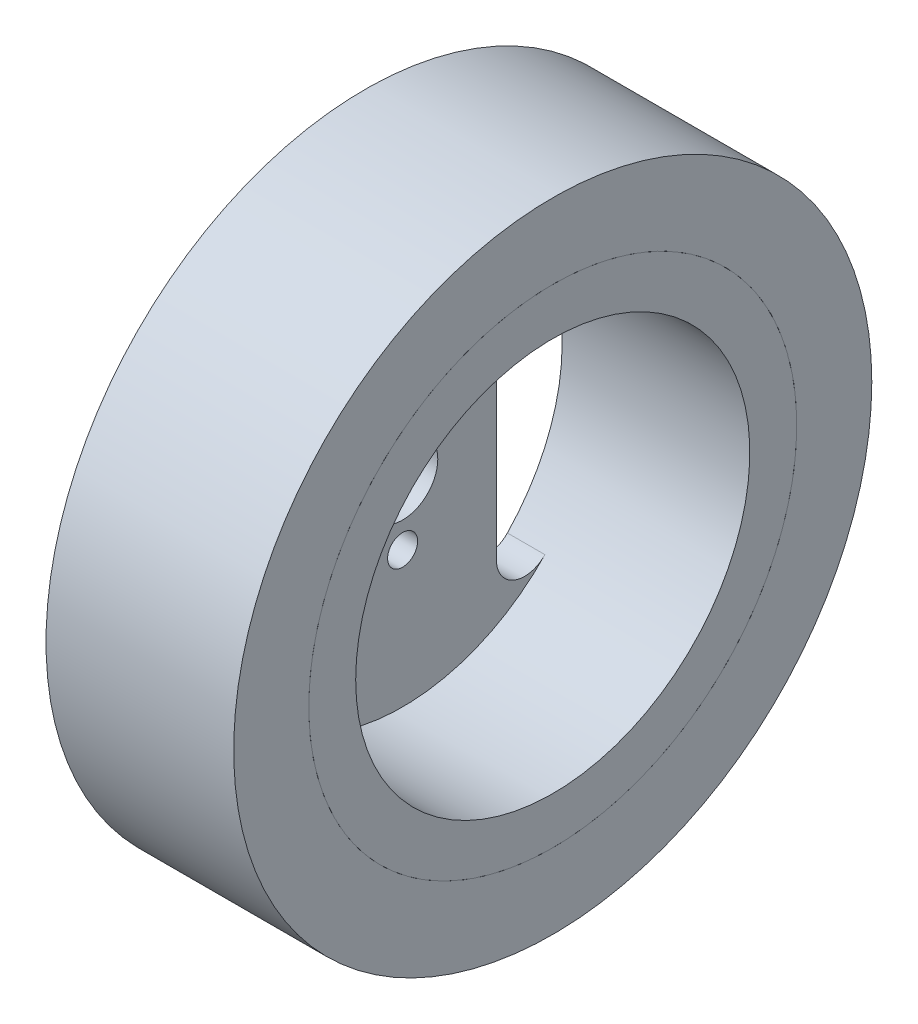
ISO-10303-21;
HEADER;
FILE_DESCRIPTION(('STEP AP214'),'2;1');
FILE_NAME('part.step','',(''),(''),'','','');
FILE_SCHEMA(('AUTOMOTIVE_DESIGN { 1 0 10303 214 1 1 1 1 }'));
ENDSEC;
DATA;
#1=APPLICATION_CONTEXT('core data for automotive mechanical design processes');
#2=APPLICATION_PROTOCOL_DEFINITION('international standard','automotive_design',2000,#1);
#3=PRODUCT_CONTEXT('',#1,'mechanical');
#4=PRODUCT('Part','Part','',(#3));
#5=PRODUCT_RELATED_PRODUCT_CATEGORY('part','',(#4));
#6=PRODUCT_DEFINITION_FORMATION('','',#4);
#7=PRODUCT_DEFINITION_CONTEXT('part definition',#1,'design');
#8=PRODUCT_DEFINITION('design','',#6,#7);
#9=PRODUCT_DEFINITION_SHAPE('','',#8);
#10=(LENGTH_UNIT() NAMED_UNIT(*) SI_UNIT(.MILLI.,.METRE.));
#11=(NAMED_UNIT(*) PLANE_ANGLE_UNIT() SI_UNIT($,.RADIAN.));
#12=(NAMED_UNIT(*) SI_UNIT($,.STERADIAN.) SOLID_ANGLE_UNIT());
#13=UNCERTAINTY_MEASURE_WITH_UNIT(LENGTH_MEASURE(1.E-05),#10,'distance_accuracy_value','');
#14=(GEOMETRIC_REPRESENTATION_CONTEXT(3) GLOBAL_UNCERTAINTY_ASSIGNED_CONTEXT((#13)) GLOBAL_UNIT_ASSIGNED_CONTEXT((#10,
#11,#12)) REPRESENTATION_CONTEXT('',''));
#15=CARTESIAN_POINT('',(0.,0.,0.));
#16=DIRECTION('',(0.,0.,1.));
#17=DIRECTION('',(1.,0.,0.));
#18=AXIS2_PLACEMENT_3D('',#15,#16,#17);
#19=CARTESIAN_POINT('',(-96.1665222413705,0.,0.));
#20=DIRECTION('',(1.,0.,0.));
#21=DIRECTION('',(0.,0.,-1.));
#22=AXIS2_PLACEMENT_3D('',#19,#20,#21);
#23=CYLINDRICAL_SURFACE('',#22,34.);
#24=CARTESIAN_POINT('',(0.,0.,0.));
#25=DIRECTION('',(1.,0.,0.));
#26=DIRECTION('',(0.,0.,-1.));
#27=AXIS2_PLACEMENT_3D('',#24,#25,#26);
#28=CIRCLE('',#27,34.);
#29=CARTESIAN_POINT('',(0.,0.,-34.));
#30=VERTEX_POINT('',#29);
#31=EDGE_CURVE('E11',#30,#30,#28,.F.);
#32=ORIENTED_EDGE('',*,*,#31,.F.);
#33=EDGE_LOOP('',(#32));
#34=FACE_BOUND('',#33,.T.);
#35=CARTESIAN_POINT('',(20.,0.,0.));
#36=DIRECTION('',(1.,0.,0.));
#37=DIRECTION('',(0.,0.,-1.));
#38=AXIS2_PLACEMENT_3D('',#35,#36,#37);
#39=CIRCLE('',#38,34.);
#40=CARTESIAN_POINT('',(20.,0.,-34.));
#41=VERTEX_POINT('',#40);
#42=EDGE_CURVE('E55',#41,#41,#39,.T.);
#43=ORIENTED_EDGE('',*,*,#42,.F.);
#44=EDGE_LOOP('',(#43));
#45=FACE_BOUND('',#44,.T.);
#46=ADVANCED_FACE('F44',(#34,#45),#23,.T.);
#47=CARTESIAN_POINT('',(20.,0.,0.));
#48=DIRECTION('',(1.,0.,0.));
#49=DIRECTION('',(0.,0.,-1.));
#50=AXIS2_PLACEMENT_3D('',#47,#48,#49);
#51=PLANE('',#50);
#52=CARTESIAN_POINT('',(20.,0.,0.));
#53=DIRECTION('',(1.,0.,0.));
#54=DIRECTION('',(0.,0.,-1.));
#55=AXIS2_PLACEMENT_3D('',#52,#53,#54);
#56=CIRCLE('',#55,26.);
#57=CARTESIAN_POINT('',(20.,0.,-26.));
#58=VERTEX_POINT('',#57);
#59=EDGE_CURVE('E57',#58,#58,#56,.T.);
#60=ORIENTED_EDGE('',*,*,#59,.F.);
#61=EDGE_LOOP('',(#60));
#62=FACE_BOUND('',#61,.T.);
#63=ORIENTED_EDGE('',*,*,#42,.T.);
#64=EDGE_LOOP('',(#63));
#65=FACE_BOUND('',#64,.T.);
#66=ADVANCED_FACE('F62',(#62,#65),#51,.T.);
#67=CARTESIAN_POINT('',(-96.1665222413705,0.,0.));
#68=DIRECTION('',(1.,0.,0.));
#69=DIRECTION('',(0.,0.,-1.));
#70=AXIS2_PLACEMENT_3D('',#67,#68,#69);
#71=CYLINDRICAL_SURFACE('',#70,26.);
#72=CARTESIAN_POINT('',(0.,0.,0.));
#73=DIRECTION('',(1.,0.,0.));
#74=DIRECTION('',(0.,0.,-1.));
#75=AXIS2_PLACEMENT_3D('',#72,#73,#74);
#76=CIRCLE('',#75,26.);
#77=CARTESIAN_POINT('',(0.,0.,-26.));
#78=VERTEX_POINT('',#77);
#79=EDGE_CURVE('E47',#78,#78,#76,.F.);
#80=ORIENTED_EDGE('',*,*,#79,.T.);
#81=EDGE_LOOP('',(#80));
#82=FACE_BOUND('',#81,.T.);
#83=ORIENTED_EDGE('',*,*,#59,.T.);
#84=EDGE_LOOP('',(#83));
#85=FACE_BOUND('',#84,.T.);
#86=ADVANCED_FACE('F69',(#82,#85),#71,.F.);
#87=CARTESIAN_POINT('',(0.,0.,0.));
#88=DIRECTION('',(1.,0.,0.));
#89=DIRECTION('',(0.,0.,-1.));
#90=AXIS2_PLACEMENT_3D('',#87,#88,#89);
#91=PLANE('',#90);
#92=ORIENTED_EDGE('',*,*,#31,.T.);
#93=EDGE_LOOP('',(#92));
#94=FACE_BOUND('',#93,.T.);
#95=ORIENTED_EDGE('',*,*,#79,.F.);
#96=EDGE_LOOP('',(#95));
#97=FACE_BOUND('',#96,.T.);
#98=ADVANCED_FACE('F74',(#94,#97),#91,.F.);
#99=CLOSED_SHELL('',(#46,#66,#86,#98));
#100=MANIFOLD_SOLID_BREP('B2',#99);
#101=CARTESIAN_POINT('',(0.,0.,0.));
#102=DIRECTION('',(1.,0.,0.));
#103=DIRECTION('',(0.,0.,-1.));
#104=AXIS2_PLACEMENT_3D('',#101,#102,#103);
#105=PLANE('',#104);
#106=DIRECTION('',(0.,1.,0.));
#107=VECTOR('',#106,1.);
#108=CARTESIAN_POINT('',(0.,0.,10.));
#109=LINE('',#108,#107);
#110=CARTESIAN_POINT('',(0.,-12.4498995979887,9.99999999999999));
#111=VERTEX_POINT('',#110);
#112=CARTESIAN_POINT('',(0.,12.4498995979887,10.));
#113=VERTEX_POINT('',#112);
#114=EDGE_CURVE('E231',#111,#113,#109,.T.);
#115=ORIENTED_EDGE('',*,*,#114,.T.);
#116=CARTESIAN_POINT('',(0.,12.4498995979887,13.));
#117=DIRECTION('',(1.,0.,0.));
#118=DIRECTION('',(0.,0.,-1.));
#119=AXIS2_PLACEMENT_3D('',#116,#117,#118);
#120=CIRCLE('',#119,3.);
#121=CARTESIAN_POINT('',(0.,14.5248828643202,15.1666666666667));
#122=VERTEX_POINT('',#121);
#123=EDGE_CURVE('E300',#113,#122,#120,.T.);
#124=ORIENTED_EDGE('',*,*,#123,.T.);
#125=CARTESIAN_POINT('',(0.,0.,0.));
#126=DIRECTION('',(1.,0.,0.));
#127=DIRECTION('',(0.,0.,-1.));
#128=AXIS2_PLACEMENT_3D('',#125,#126,#127);
#129=CIRCLE('',#128,21.);
#130=CARTESIAN_POINT('',(0.,-14.5248828643202,15.1666666666667));
#131=VERTEX_POINT('',#130);
#132=EDGE_CURVE('E291',#122,#131,#129,.T.);
#133=ORIENTED_EDGE('',*,*,#132,.T.);
#134=CARTESIAN_POINT('',(0.,-12.4498995979887,13.));
#135=DIRECTION('',(1.,0.,0.));
#136=DIRECTION('',(0.,0.,-1.));
#137=AXIS2_PLACEMENT_3D('',#134,#135,#136);
#138=CIRCLE('',#137,3.);
#139=EDGE_CURVE('E173',#131,#111,#138,.T.);
#140=ORIENTED_EDGE('',*,*,#139,.T.);
#141=EDGE_LOOP('',(#115,#124,#133,#140));
#142=FACE_BOUND('',#141,.T.);
#143=CARTESIAN_POINT('',(0.,-6.5,0.));
#144=DIRECTION('',(1.,0.,0.));
#145=DIRECTION('',(0.,0.,-1.));
#146=AXIS2_PLACEMENT_3D('',#143,#144,#145);
#147=CIRCLE('',#146,1.6);
#148=CARTESIAN_POINT('',(0.,-6.5,-1.6));
#149=VERTEX_POINT('',#148);
#150=EDGE_CURVE('E235',#149,#149,#147,.T.);
#151=ORIENTED_EDGE('',*,*,#150,.T.);
#152=EDGE_LOOP('',(#151));
#153=FACE_BOUND('',#152,.T.);
#154=CARTESIAN_POINT('',(0.,6.5,0.));
#155=DIRECTION('',(1.,0.,0.));
#156=DIRECTION('',(0.,0.,-1.));
#157=AXIS2_PLACEMENT_3D('',#154,#155,#156);
#158=CIRCLE('',#157,1.6);
#159=CARTESIAN_POINT('',(0.,6.5,-1.6));
#160=VERTEX_POINT('',#159);
#161=EDGE_CURVE('E239',#160,#160,#158,.T.);
#162=ORIENTED_EDGE('',*,*,#161,.T.);
#163=EDGE_LOOP('',(#162));
#164=FACE_BOUND('',#163,.T.);
#165=DIRECTION('',(0.,-1.,0.));
#166=VECTOR('',#165,1.);
#167=CARTESIAN_POINT('',(0.,0.,-10.));
#168=LINE('',#167,#166);
#169=CARTESIAN_POINT('',(0.,12.4498995979887,-10.));
#170=VERTEX_POINT('',#169);
#171=CARTESIAN_POINT('',(0.,-12.4498995979887,-9.99999999999999));
#172=VERTEX_POINT('',#171);
#173=EDGE_CURVE('E244',#170,#172,#168,.T.);
#174=ORIENTED_EDGE('',*,*,#173,.T.);
#175=CARTESIAN_POINT('',(0.,-12.4498995979887,-13.));
#176=DIRECTION('',(1.,0.,0.));
#177=DIRECTION('',(0.,0.,-1.));
#178=AXIS2_PLACEMENT_3D('',#175,#176,#177);
#179=CIRCLE('',#178,3.);
#180=CARTESIAN_POINT('',(0.,-14.5248828643202,-15.1666666666667));
#181=VERTEX_POINT('',#180);
#182=EDGE_CURVE('E294',#172,#181,#179,.T.);
#183=ORIENTED_EDGE('',*,*,#182,.T.);
#184=CARTESIAN_POINT('',(0.,0.,0.));
#185=DIRECTION('',(1.,0.,0.));
#186=DIRECTION('',(0.,0.,-1.));
#187=AXIS2_PLACEMENT_3D('',#184,#185,#186);
#188=CIRCLE('',#187,21.);
#189=CARTESIAN_POINT('',(0.,14.5248828643202,-15.1666666666667));
#190=VERTEX_POINT('',#189);
#191=EDGE_CURVE('E324',#181,#190,#188,.T.);
#192=ORIENTED_EDGE('',*,*,#191,.T.);
#193=CARTESIAN_POINT('',(0.,12.4498995979887,-13.));
#194=DIRECTION('',(1.,0.,0.));
#195=DIRECTION('',(0.,0.,-1.));
#196=AXIS2_PLACEMENT_3D('',#193,#194,#195);
#197=CIRCLE('',#196,3.);
#198=EDGE_CURVE('E333',#190,#170,#197,.T.);
#199=ORIENTED_EDGE('',*,*,#198,.T.);
#200=EDGE_LOOP('',(#174,#183,#192,#199));
#201=FACE_BOUND('',#200,.T.);
#202=CARTESIAN_POINT('',(0.,0.,0.));
#203=DIRECTION('',(1.,0.,0.));
#204=DIRECTION('',(0.,0.,-1.));
#205=AXIS2_PLACEMENT_3D('',#202,#203,#204);
#206=CIRCLE('',#205,3.75);
#207=CARTESIAN_POINT('',(0.,0.,-3.75));
#208=VERTEX_POINT('',#207);
#209=EDGE_CURVE('E194',#208,#208,#206,.T.);
#210=ORIENTED_EDGE('',*,*,#209,.T.);
#211=EDGE_LOOP('',(#210));
#212=FACE_BOUND('',#211,.T.);
#213=CARTESIAN_POINT('',(0.,0.,0.));
#214=DIRECTION('',(-1.,0.,0.));
#215=DIRECTION('',(0.,0.,1.));
#216=AXIS2_PLACEMENT_3D('',#213,#214,#215);
#217=CIRCLE('',#216,26.);
#218=CARTESIAN_POINT('',(0.,0.,26.));
#219=VERTEX_POINT('',#218);
#220=EDGE_CURVE('E42',#219,#219,#217,.T.);
#221=ORIENTED_EDGE('',*,*,#220,.T.);
#222=EDGE_LOOP('',(#221));
#223=FACE_BOUND('',#222,.T.);
#224=ADVANCED_FACE('F105',(#142,#153,#164,#201,#212,#223),#105,.F.);
#225=CARTESIAN_POINT('',(0.,0.,0.));
#226=DIRECTION('',(-1.,0.,0.));
#227=DIRECTION('',(0.,0.,1.));
#228=AXIS2_PLACEMENT_3D('',#225,#226,#227);
#229=CYLINDRICAL_SURFACE('',#228,26.);
#230=ORIENTED_EDGE('',*,*,#220,.F.);
#231=EDGE_LOOP('',(#230));
#232=FACE_BOUND('',#231,.T.);
#233=CARTESIAN_POINT('',(20.,0.,0.));
#234=DIRECTION('',(-1.,0.,0.));
#235=DIRECTION('',(0.,0.,1.));
#236=AXIS2_PLACEMENT_3D('',#233,#234,#235);
#237=CIRCLE('',#236,26.);
#238=CARTESIAN_POINT('',(20.,0.,26.));
#239=VERTEX_POINT('',#238);
#240=EDGE_CURVE('E112',#239,#239,#237,.T.);
#241=ORIENTED_EDGE('',*,*,#240,.T.);
#242=EDGE_LOOP('',(#241));
#243=FACE_BOUND('',#242,.T.);
#244=ADVANCED_FACE('F206',(#232,#243),#229,.T.);
#245=CARTESIAN_POINT('',(20.,26.,0.));
#246=DIRECTION('',(-1.,0.,0.));
#247=DIRECTION('',(0.,0.,1.));
#248=AXIS2_PLACEMENT_3D('',#245,#246,#247);
#249=PLANE('',#248);
#250=ORIENTED_EDGE('',*,*,#240,.F.);
#251=EDGE_LOOP('',(#250));
#252=FACE_BOUND('',#251,.T.);
#253=CARTESIAN_POINT('',(20.,0.,0.));
#254=DIRECTION('',(-1.,0.,0.));
#255=DIRECTION('',(0.,0.,1.));
#256=AXIS2_PLACEMENT_3D('',#253,#254,#255);
#257=CIRCLE('',#256,21.);
#258=CARTESIAN_POINT('',(20.,0.,21.));
#259=VERTEX_POINT('',#258);
#260=EDGE_CURVE('E196',#259,#259,#257,.T.);
#261=ORIENTED_EDGE('',*,*,#260,.T.);
#262=EDGE_LOOP('',(#261));
#263=FACE_BOUND('',#262,.T.);
#264=ADVANCED_FACE('F208',(#252,#263),#249,.F.);
#265=CARTESIAN_POINT('',(0.,0.,0.));
#266=DIRECTION('',(-1.,0.,0.));
#267=DIRECTION('',(0.,0.,1.));
#268=AXIS2_PLACEMENT_3D('',#265,#266,#267);
#269=CYLINDRICAL_SURFACE('',#268,21.);
#270=ORIENTED_EDGE('',*,*,#260,.F.);
#271=EDGE_LOOP('',(#270));
#272=FACE_BOUND('',#271,.T.);
#273=CARTESIAN_POINT('',(4.,0.,0.));
#274=DIRECTION('',(-1.,0.,0.));
#275=DIRECTION('',(0.,0.,1.));
#276=AXIS2_PLACEMENT_3D('',#273,#274,#275);
#277=CIRCLE('',#276,21.);
#278=CARTESIAN_POINT('',(4.,14.5248828643202,15.1666666666667));
#279=VERTEX_POINT('',#278);
#280=CARTESIAN_POINT('',(4.,14.5248828643202,-15.1666666666667));
#281=VERTEX_POINT('',#280);
#282=EDGE_CURVE('E193',#279,#281,#277,.T.);
#283=ORIENTED_EDGE('',*,*,#282,.T.);
#284=DIRECTION('',(1.,0.,0.));
#285=VECTOR('',#284,1.);
#286=CARTESIAN_POINT('',(-6.,14.5248828643202,-15.1666666666667));
#287=LINE('',#286,#285);
#288=EDGE_CURVE('E126',#190,#281,#287,.T.);
#289=ORIENTED_EDGE('',*,*,#288,.F.);
#290=ORIENTED_EDGE('',*,*,#191,.F.);
#291=DIRECTION('',(1.,0.,0.));
#292=VECTOR('',#291,1.);
#293=CARTESIAN_POINT('',(-6.,-14.5248828643202,-15.1666666666667));
#294=LINE('',#293,#292);
#295=CARTESIAN_POINT('',(4.,-14.5248828643202,-15.1666666666667));
#296=VERTEX_POINT('',#295);
#297=EDGE_CURVE('E192',#181,#296,#294,.T.);
#298=ORIENTED_EDGE('',*,*,#297,.T.);
#299=CARTESIAN_POINT('',(4.,-14.5248828643202,15.1666666666667));
#300=VERTEX_POINT('',#299);
#301=EDGE_CURVE('E183',#296,#300,#277,.T.);
#302=ORIENTED_EDGE('',*,*,#301,.T.);
#303=DIRECTION('',(1.,0.,0.));
#304=VECTOR('',#303,1.);
#305=CARTESIAN_POINT('',(-6.,-14.5248828643202,15.1666666666667));
#306=LINE('',#305,#304);
#307=EDGE_CURVE('E119',#131,#300,#306,.T.);
#308=ORIENTED_EDGE('',*,*,#307,.F.);
#309=ORIENTED_EDGE('',*,*,#132,.F.);
#310=DIRECTION('',(1.,0.,0.));
#311=VECTOR('',#310,1.);
#312=CARTESIAN_POINT('',(-6.,14.5248828643202,15.1666666666667));
#313=LINE('',#312,#311);
#314=EDGE_CURVE('E176',#122,#279,#313,.T.);
#315=ORIENTED_EDGE('',*,*,#314,.T.);
#316=EDGE_LOOP('',(#283,#289,#290,#298,#302,#308,#309,#315));
#317=FACE_BOUND('',#316,.T.);
#318=ADVANCED_FACE('F190',(#272,#317),#269,.F.);
#319=CARTESIAN_POINT('',(4.,21.,0.));
#320=DIRECTION('',(-1.,0.,0.));
#321=DIRECTION('',(0.,0.,1.));
#322=AXIS2_PLACEMENT_3D('',#319,#320,#321);
#323=PLANE('',#322);
#324=CARTESIAN_POINT('',(4.,-6.5,0.));
#325=DIRECTION('',(1.,0.,0.));
#326=DIRECTION('',(0.,0.,-1.));
#327=AXIS2_PLACEMENT_3D('',#324,#325,#326);
#328=CIRCLE('',#327,1.6);
#329=CARTESIAN_POINT('',(4.,-6.5,-1.6));
#330=VERTEX_POINT('',#329);
#331=EDGE_CURVE('E290',#330,#330,#328,.T.);
#332=ORIENTED_EDGE('',*,*,#331,.F.);
#333=EDGE_LOOP('',(#332));
#334=FACE_BOUND('',#333,.T.);
#335=CARTESIAN_POINT('',(4.,6.5,0.));
#336=DIRECTION('',(1.,0.,0.));
#337=DIRECTION('',(0.,0.,-1.));
#338=AXIS2_PLACEMENT_3D('',#335,#336,#337);
#339=CIRCLE('',#338,1.6);
#340=CARTESIAN_POINT('',(4.,6.5,-1.6));
#341=VERTEX_POINT('',#340);
#342=EDGE_CURVE('E308',#341,#341,#339,.T.);
#343=ORIENTED_EDGE('',*,*,#342,.F.);
#344=EDGE_LOOP('',(#343));
#345=FACE_BOUND('',#344,.T.);
#346=CARTESIAN_POINT('',(4.,0.,0.));
#347=DIRECTION('',(1.,0.,0.));
#348=DIRECTION('',(0.,0.,-1.));
#349=AXIS2_PLACEMENT_3D('',#346,#347,#348);
#350=CIRCLE('',#349,3.75);
#351=CARTESIAN_POINT('',(4.,0.,-3.75));
#352=VERTEX_POINT('',#351);
#353=EDGE_CURVE('E198',#352,#352,#350,.T.);
#354=ORIENTED_EDGE('',*,*,#353,.F.);
#355=EDGE_LOOP('',(#354));
#356=FACE_BOUND('',#355,.T.);
#357=ORIENTED_EDGE('',*,*,#282,.F.);
#358=CARTESIAN_POINT('',(4.,12.4498995979887,13.));
#359=DIRECTION('',(1.,0.,0.));
#360=DIRECTION('',(0.,0.,-1.));
#361=AXIS2_PLACEMENT_3D('',#358,#359,#360);
#362=CIRCLE('',#361,3.);
#363=CARTESIAN_POINT('',(4.,12.4498995979887,10.));
#364=VERTEX_POINT('',#363);
#365=EDGE_CURVE('E187',#364,#279,#362,.T.);
#366=ORIENTED_EDGE('',*,*,#365,.F.);
#367=DIRECTION('',(0.,1.,0.));
#368=VECTOR('',#367,1.);
#369=CARTESIAN_POINT('',(4.,12.4498995979887,10.));
#370=LINE('',#369,#368);
#371=CARTESIAN_POINT('',(4.,-12.4498995979887,9.99999999999999));
#372=VERTEX_POINT('',#371);
#373=EDGE_CURVE('E186',#372,#364,#370,.T.);
#374=ORIENTED_EDGE('',*,*,#373,.F.);
#375=CARTESIAN_POINT('',(4.,-12.4498995979887,13.));
#376=DIRECTION('',(1.,0.,0.));
#377=DIRECTION('',(0.,0.,1.));
#378=AXIS2_PLACEMENT_3D('',#375,#376,#377);
#379=CIRCLE('',#378,3.);
#380=EDGE_CURVE('E170',#300,#372,#379,.T.);
#381=ORIENTED_EDGE('',*,*,#380,.F.);
#382=ORIENTED_EDGE('',*,*,#301,.F.);
#383=CARTESIAN_POINT('',(4.,-12.4498995979887,-13.));
#384=DIRECTION('',(1.,0.,0.));
#385=DIRECTION('',(0.,0.,-1.));
#386=AXIS2_PLACEMENT_3D('',#383,#384,#385);
#387=CIRCLE('',#386,3.);
#388=CARTESIAN_POINT('',(4.,-12.4498995979887,-9.99999999999999));
#389=VERTEX_POINT('',#388);
#390=EDGE_CURVE('E314',#389,#296,#387,.T.);
#391=ORIENTED_EDGE('',*,*,#390,.F.);
#392=DIRECTION('',(0.,-1.,0.));
#393=VECTOR('',#392,1.);
#394=CARTESIAN_POINT('',(4.,12.4498995979887,-10.));
#395=LINE('',#394,#393);
#396=CARTESIAN_POINT('',(4.,12.4498995979887,-10.));
#397=VERTEX_POINT('',#396);
#398=EDGE_CURVE('E319',#397,#389,#395,.T.);
#399=ORIENTED_EDGE('',*,*,#398,.F.);
#400=CARTESIAN_POINT('',(4.,12.4498995979887,-13.));
#401=DIRECTION('',(1.,0.,0.));
#402=DIRECTION('',(0.,0.,1.));
#403=AXIS2_PLACEMENT_3D('',#400,#401,#402);
#404=CIRCLE('',#403,3.);
#405=EDGE_CURVE('E316',#281,#397,#404,.T.);
#406=ORIENTED_EDGE('',*,*,#405,.F.);
#407=EDGE_LOOP('',(#357,#366,#374,#381,#382,#391,#399,#406));
#408=FACE_BOUND('',#407,.T.);
#409=ADVANCED_FACE('F181',(#334,#345,#356,#408),#323,.F.);
#410=CARTESIAN_POINT('',(-6.,0.,0.));
#411=DIRECTION('',(1.,0.,0.));
#412=DIRECTION('',(0.,0.,-1.));
#413=AXIS2_PLACEMENT_3D('',#410,#411,#412);
#414=CYLINDRICAL_SURFACE('',#413,3.75);
#415=ORIENTED_EDGE('',*,*,#353,.T.);
#416=EDGE_LOOP('',(#415));
#417=FACE_BOUND('',#416,.T.);
#418=ORIENTED_EDGE('',*,*,#209,.F.);
#419=EDGE_LOOP('',(#418));
#420=FACE_BOUND('',#419,.T.);
#421=ADVANCED_FACE('F219',(#417,#420),#414,.F.);
#422=CARTESIAN_POINT('',(-6.,-12.4498995979887,-13.));
#423=DIRECTION('',(1.,0.,0.));
#424=DIRECTION('',(0.,0.,-1.));
#425=AXIS2_PLACEMENT_3D('',#422,#423,#424);
#426=CYLINDRICAL_SURFACE('',#425,3.);
#427=DIRECTION('',(1.,0.,0.));
#428=VECTOR('',#427,1.);
#429=CARTESIAN_POINT('',(-6.,-12.4498995979887,-9.99999999999999));
#430=LINE('',#429,#428);
#431=EDGE_CURVE('E322',#172,#389,#430,.T.);
#432=ORIENTED_EDGE('',*,*,#431,.T.);
#433=ORIENTED_EDGE('',*,*,#390,.T.);
#434=ORIENTED_EDGE('',*,*,#297,.F.);
#435=ORIENTED_EDGE('',*,*,#182,.F.);
#436=EDGE_LOOP('',(#432,#433,#434,#435));
#437=FACE_BOUND('',#436,.T.);
#438=ADVANCED_FACE('F250',(#437),#426,.F.);
#439=CARTESIAN_POINT('',(-6.,12.4498995979887,-10.));
#440=DIRECTION('',(0.,0.,1.));
#441=DIRECTION('',(0.,-1.,0.));
#442=AXIS2_PLACEMENT_3D('',#439,#440,#441);
#443=PLANE('',#442);
#444=DIRECTION('',(1.,0.,0.));
#445=VECTOR('',#444,1.);
#446=CARTESIAN_POINT('',(-6.,12.4498995979887,-10.));
#447=LINE('',#446,#445);
#448=EDGE_CURVE('E325',#170,#397,#447,.T.);
#449=ORIENTED_EDGE('',*,*,#448,.T.);
#450=ORIENTED_EDGE('',*,*,#398,.T.);
#451=ORIENTED_EDGE('',*,*,#431,.F.);
#452=ORIENTED_EDGE('',*,*,#173,.F.);
#453=EDGE_LOOP('',(#449,#450,#451,#452));
#454=FACE_BOUND('',#453,.T.);
#455=ADVANCED_FACE('F256',(#454),#443,.F.);
#456=CARTESIAN_POINT('',(-6.,12.4498995979887,-13.));
#457=DIRECTION('',(1.,0.,0.));
#458=DIRECTION('',(0.,0.,-1.));
#459=AXIS2_PLACEMENT_3D('',#456,#457,#458);
#460=CYLINDRICAL_SURFACE('',#459,3.);
#461=ORIENTED_EDGE('',*,*,#288,.T.);
#462=ORIENTED_EDGE('',*,*,#405,.T.);
#463=ORIENTED_EDGE('',*,*,#448,.F.);
#464=ORIENTED_EDGE('',*,*,#198,.F.);
#465=EDGE_LOOP('',(#461,#462,#463,#464));
#466=FACE_BOUND('',#465,.T.);
#467=ADVANCED_FACE('F264',(#466),#460,.F.);
#468=CARTESIAN_POINT('',(-6.,6.5,0.));
#469=DIRECTION('',(1.,0.,0.));
#470=DIRECTION('',(0.,0.,-1.));
#471=AXIS2_PLACEMENT_3D('',#468,#469,#470);
#472=CYLINDRICAL_SURFACE('',#471,1.6);
#473=ORIENTED_EDGE('',*,*,#342,.T.);
#474=EDGE_LOOP('',(#473));
#475=FACE_BOUND('',#474,.T.);
#476=ORIENTED_EDGE('',*,*,#161,.F.);
#477=EDGE_LOOP('',(#476));
#478=FACE_BOUND('',#477,.T.);
#479=ADVANCED_FACE('F261',(#475,#478),#472,.F.);
#480=CARTESIAN_POINT('',(-6.,-6.5,0.));
#481=DIRECTION('',(1.,0.,0.));
#482=DIRECTION('',(0.,0.,-1.));
#483=AXIS2_PLACEMENT_3D('',#480,#481,#482);
#484=CYLINDRICAL_SURFACE('',#483,1.6);
#485=ORIENTED_EDGE('',*,*,#331,.T.);
#486=EDGE_LOOP('',(#485));
#487=FACE_BOUND('',#486,.T.);
#488=ORIENTED_EDGE('',*,*,#150,.F.);
#489=EDGE_LOOP('',(#488));
#490=FACE_BOUND('',#489,.T.);
#491=ADVANCED_FACE('F263',(#487,#490),#484,.F.);
#492=CARTESIAN_POINT('',(-6.,12.4498995979887,13.));
#493=DIRECTION('',(1.,0.,0.));
#494=DIRECTION('',(0.,0.,-1.));
#495=AXIS2_PLACEMENT_3D('',#492,#493,#494);
#496=CYLINDRICAL_SURFACE('',#495,3.);
#497=DIRECTION('',(1.,0.,0.));
#498=VECTOR('',#497,1.);
#499=CARTESIAN_POINT('',(-6.,12.4498995979887,10.));
#500=LINE('',#499,#498);
#501=EDGE_CURVE('E305',#113,#364,#500,.T.);
#502=ORIENTED_EDGE('',*,*,#501,.T.);
#503=ORIENTED_EDGE('',*,*,#365,.T.);
#504=ORIENTED_EDGE('',*,*,#314,.F.);
#505=ORIENTED_EDGE('',*,*,#123,.F.);
#506=EDGE_LOOP('',(#502,#503,#504,#505));
#507=FACE_BOUND('',#506,.T.);
#508=ADVANCED_FACE('F273',(#507),#496,.F.);
#509=CARTESIAN_POINT('',(-6.,12.4498995979887,10.));
#510=DIRECTION('',(0.,0.,-1.));
#511=DIRECTION('',(0.,1.,0.));
#512=AXIS2_PLACEMENT_3D('',#509,#510,#511);
#513=PLANE('',#512);
#514=DIRECTION('',(1.,0.,0.));
#515=VECTOR('',#514,1.);
#516=CARTESIAN_POINT('',(-6.,-12.4498995979887,9.99999999999999));
#517=LINE('',#516,#515);
#518=EDGE_CURVE('E175',#111,#372,#517,.T.);
#519=ORIENTED_EDGE('',*,*,#518,.T.);
#520=ORIENTED_EDGE('',*,*,#373,.T.);
#521=ORIENTED_EDGE('',*,*,#501,.F.);
#522=ORIENTED_EDGE('',*,*,#114,.F.);
#523=EDGE_LOOP('',(#519,#520,#521,#522));
#524=FACE_BOUND('',#523,.T.);
#525=ADVANCED_FACE('F276',(#524),#513,.F.);
#526=CARTESIAN_POINT('',(-6.,-12.4498995979887,13.));
#527=DIRECTION('',(1.,0.,0.));
#528=DIRECTION('',(0.,0.,-1.));
#529=AXIS2_PLACEMENT_3D('',#526,#527,#528);
#530=CYLINDRICAL_SURFACE('',#529,3.);
#531=ORIENTED_EDGE('',*,*,#307,.T.);
#532=ORIENTED_EDGE('',*,*,#380,.T.);
#533=ORIENTED_EDGE('',*,*,#518,.F.);
#534=ORIENTED_EDGE('',*,*,#139,.F.);
#535=EDGE_LOOP('',(#531,#532,#533,#534));
#536=FACE_BOUND('',#535,.T.);
#537=ADVANCED_FACE('F168',(#536),#530,.F.);
#538=CLOSED_SHELL('',(#224,#244,#264,#318,#409,#421,#438,#455,#467,#479,#491,#508,#525,#537));
#539=MANIFOLD_SOLID_BREP('B6',#538);
#540=ADVANCED_BREP_SHAPE_REPRESENTATION('',(#18,#100,#539),#14);
#541=SHAPE_DEFINITION_REPRESENTATION(#9,#540);
ENDSEC;
END-ISO-10303-21;
